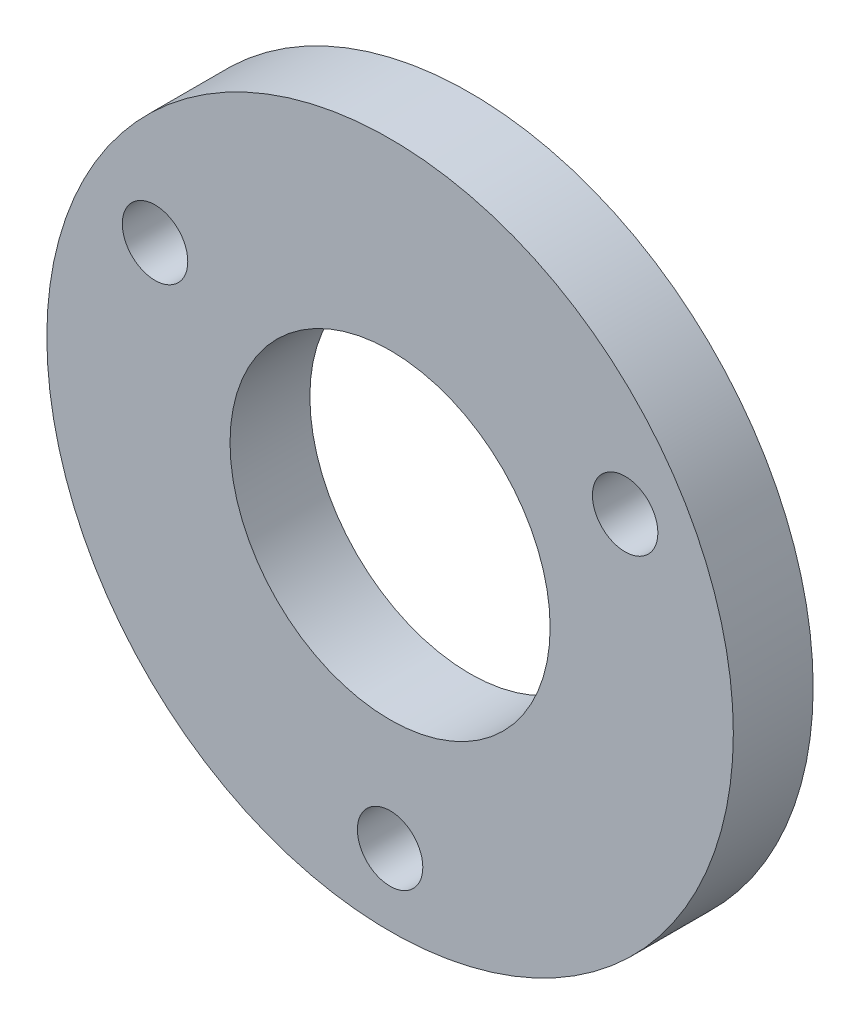
ISO-10303-21;
HEADER;
FILE_DESCRIPTION(('STEP AP214'),'2;1');
FILE_NAME('part.step','',(''),(''),'','','');
FILE_SCHEMA(('AUTOMOTIVE_DESIGN { 1 0 10303 214 1 1 1 1 }'));
ENDSEC;
DATA;
#1=APPLICATION_CONTEXT('core data for automotive mechanical design processes');
#2=APPLICATION_PROTOCOL_DEFINITION('international standard','automotive_design',2000,#1);
#3=PRODUCT_CONTEXT('',#1,'mechanical');
#4=PRODUCT('Part','Part','',(#3));
#5=PRODUCT_RELATED_PRODUCT_CATEGORY('part','',(#4));
#6=PRODUCT_DEFINITION_FORMATION('','',#4);
#7=PRODUCT_DEFINITION_CONTEXT('part definition',#1,'design');
#8=PRODUCT_DEFINITION('design','',#6,#7);
#9=PRODUCT_DEFINITION_SHAPE('','',#8);
#10=(LENGTH_UNIT() NAMED_UNIT(*) SI_UNIT(.MILLI.,.METRE.));
#11=(NAMED_UNIT(*) PLANE_ANGLE_UNIT() SI_UNIT($,.RADIAN.));
#12=(NAMED_UNIT(*) SI_UNIT($,.STERADIAN.) SOLID_ANGLE_UNIT());
#13=UNCERTAINTY_MEASURE_WITH_UNIT(LENGTH_MEASURE(1.E-05),#10,'distance_accuracy_value','');
#14=(GEOMETRIC_REPRESENTATION_CONTEXT(3) GLOBAL_UNCERTAINTY_ASSIGNED_CONTEXT((#13)) GLOBAL_UNIT_ASSIGNED_CONTEXT((#10,
#11,#12)) REPRESENTATION_CONTEXT('',''));
#15=CARTESIAN_POINT('',(0.,0.,0.));
#16=DIRECTION('',(0.,0.,1.));
#17=DIRECTION('',(1.,0.,0.));
#18=AXIS2_PLACEMENT_3D('',#15,#16,#17);
#19=CARTESIAN_POINT('',(0.,0.,5.));
#20=DIRECTION('',(0.,0.,-1.));
#21=DIRECTION('',(-1.,0.,0.));
#22=AXIS2_PLACEMENT_3D('',#19,#20,#21);
#23=CYLINDRICAL_SURFACE('',#22,21.5);
#24=CARTESIAN_POINT('',(0.,0.,5.));
#25=DIRECTION('',(0.,0.,1.));
#26=DIRECTION('',(1.,0.,0.));
#27=AXIS2_PLACEMENT_3D('',#24,#25,#26);
#28=CIRCLE('',#27,21.5);
#29=CARTESIAN_POINT('',(21.5,0.,5.));
#30=VERTEX_POINT('',#29);
#31=EDGE_CURVE('E10',#30,#30,#28,.T.);
#32=ORIENTED_EDGE('',*,*,#31,.F.);
#33=EDGE_LOOP('',(#32));
#34=FACE_BOUND('',#33,.T.);
#35=CARTESIAN_POINT('',(0.,0.,0.));
#36=DIRECTION('',(0.,0.,1.));
#37=DIRECTION('',(1.,0.,0.));
#38=AXIS2_PLACEMENT_3D('',#35,#36,#37);
#39=CIRCLE('',#38,21.5);
#40=CARTESIAN_POINT('',(21.5,0.,0.));
#41=VERTEX_POINT('',#40);
#42=EDGE_CURVE('E35',#41,#41,#39,.T.);
#43=ORIENTED_EDGE('',*,*,#42,.T.);
#44=EDGE_LOOP('',(#43));
#45=FACE_BOUND('',#44,.T.);
#46=ADVANCED_FACE('F32',(#34,#45),#23,.T.);
#47=CARTESIAN_POINT('',(0.,0.,5.));
#48=DIRECTION('',(0.,0.,1.));
#49=DIRECTION('',(1.,0.,0.));
#50=AXIS2_PLACEMENT_3D('',#47,#48,#49);
#51=PLANE('',#50);
#52=CARTESIAN_POINT('',(0.,-17.,5.));
#53=DIRECTION('',(0.,0.,1.));
#54=DIRECTION('',(1.,0.,0.));
#55=AXIS2_PLACEMENT_3D('',#52,#53,#54);
#56=CIRCLE('',#55,2.05);
#57=CARTESIAN_POINT('',(2.05,-17.,5.));
#58=VERTEX_POINT('',#57);
#59=EDGE_CURVE('E62',#58,#58,#56,.T.);
#60=ORIENTED_EDGE('',*,*,#59,.F.);
#61=EDGE_LOOP('',(#60));
#62=FACE_BOUND('',#61,.T.);
#63=CARTESIAN_POINT('',(-14.7224318643355,8.5,5.));
#64=DIRECTION('',(0.,0.,1.));
#65=DIRECTION('',(1.,0.,0.));
#66=AXIS2_PLACEMENT_3D('',#63,#64,#65);
#67=CIRCLE('',#66,2.05);
#68=CARTESIAN_POINT('',(-12.6724318643355,8.5,5.));
#69=VERTEX_POINT('',#68);
#70=EDGE_CURVE('E56',#69,#69,#67,.T.);
#71=ORIENTED_EDGE('',*,*,#70,.F.);
#72=EDGE_LOOP('',(#71));
#73=FACE_BOUND('',#72,.T.);
#74=CARTESIAN_POINT('',(14.7224318643355,8.50000000000001,5.));
#75=DIRECTION('',(0.,0.,1.));
#76=DIRECTION('',(1.,0.,0.));
#77=AXIS2_PLACEMENT_3D('',#74,#75,#76);
#78=CIRCLE('',#77,2.05);
#79=CARTESIAN_POINT('',(16.7724318643355,8.50000000000001,5.));
#80=VERTEX_POINT('',#79);
#81=EDGE_CURVE('E50',#80,#80,#78,.T.);
#82=ORIENTED_EDGE('',*,*,#81,.F.);
#83=EDGE_LOOP('',(#82));
#84=FACE_BOUND('',#83,.T.);
#85=CARTESIAN_POINT('',(0.,0.,5.));
#86=DIRECTION('',(0.,0.,1.));
#87=DIRECTION('',(1.,0.,0.));
#88=AXIS2_PLACEMENT_3D('',#85,#86,#87);
#89=CIRCLE('',#88,10.025);
#90=CARTESIAN_POINT('',(10.025,0.,5.));
#91=VERTEX_POINT('',#90);
#92=EDGE_CURVE('E44',#91,#91,#89,.T.);
#93=ORIENTED_EDGE('',*,*,#92,.F.);
#94=EDGE_LOOP('',(#93));
#95=FACE_BOUND('',#94,.T.);
#96=ORIENTED_EDGE('',*,*,#31,.T.);
#97=EDGE_LOOP('',(#96));
#98=FACE_BOUND('',#97,.T.);
#99=ADVANCED_FACE('F78',(#62,#73,#84,#95,#98),#51,.T.);
#100=CARTESIAN_POINT('',(0.,0.,0.));
#101=DIRECTION('',(0.,0.,1.));
#102=DIRECTION('',(1.,0.,0.));
#103=AXIS2_PLACEMENT_3D('',#100,#101,#102);
#104=PLANE('',#103);
#105=CARTESIAN_POINT('',(0.,-17.,0.));
#106=DIRECTION('',(0.,0.,1.));
#107=DIRECTION('',(1.,0.,0.));
#108=AXIS2_PLACEMENT_3D('',#105,#106,#107);
#109=CIRCLE('',#108,2.05);
#110=CARTESIAN_POINT('',(2.05,-17.,0.));
#111=VERTEX_POINT('',#110);
#112=EDGE_CURVE('E47',#111,#111,#109,.T.);
#113=ORIENTED_EDGE('',*,*,#112,.T.);
#114=EDGE_LOOP('',(#113));
#115=FACE_BOUND('',#114,.T.);
#116=CARTESIAN_POINT('',(-14.7224318643355,8.5,0.));
#117=DIRECTION('',(0.,0.,1.));
#118=DIRECTION('',(1.,0.,0.));
#119=AXIS2_PLACEMENT_3D('',#116,#117,#118);
#120=CIRCLE('',#119,2.05);
#121=CARTESIAN_POINT('',(-12.6724318643355,8.5,0.));
#122=VERTEX_POINT('',#121);
#123=EDGE_CURVE('E59',#122,#122,#120,.T.);
#124=ORIENTED_EDGE('',*,*,#123,.T.);
#125=EDGE_LOOP('',(#124));
#126=FACE_BOUND('',#125,.T.);
#127=CARTESIAN_POINT('',(14.7224318643355,8.50000000000001,0.));
#128=DIRECTION('',(0.,0.,1.));
#129=DIRECTION('',(1.,0.,0.));
#130=AXIS2_PLACEMENT_3D('',#127,#128,#129);
#131=CIRCLE('',#130,2.05);
#132=CARTESIAN_POINT('',(16.7724318643355,8.50000000000001,0.));
#133=VERTEX_POINT('',#132);
#134=EDGE_CURVE('E53',#133,#133,#131,.T.);
#135=ORIENTED_EDGE('',*,*,#134,.T.);
#136=EDGE_LOOP('',(#135));
#137=FACE_BOUND('',#136,.T.);
#138=CARTESIAN_POINT('',(0.,0.,0.));
#139=DIRECTION('',(0.,0.,1.));
#140=DIRECTION('',(1.,0.,0.));
#141=AXIS2_PLACEMENT_3D('',#138,#139,#140);
#142=CIRCLE('',#141,10.025);
#143=CARTESIAN_POINT('',(10.025,0.,0.));
#144=VERTEX_POINT('',#143);
#145=EDGE_CURVE('E42',#144,#144,#142,.T.);
#146=ORIENTED_EDGE('',*,*,#145,.T.);
#147=EDGE_LOOP('',(#146));
#148=FACE_BOUND('',#147,.T.);
#149=ORIENTED_EDGE('',*,*,#42,.F.);
#150=EDGE_LOOP('',(#149));
#151=FACE_BOUND('',#150,.T.);
#152=ADVANCED_FACE('F68',(#115,#126,#137,#148,#151),#104,.F.);
#153=CARTESIAN_POINT('',(0.,0.,0.));
#154=DIRECTION('',(0.,0.,1.));
#155=DIRECTION('',(1.,0.,0.));
#156=AXIS2_PLACEMENT_3D('',#153,#154,#155);
#157=CYLINDRICAL_SURFACE('',#156,10.025);
#158=ORIENTED_EDGE('',*,*,#145,.F.);
#159=EDGE_LOOP('',(#158));
#160=FACE_BOUND('',#159,.T.);
#161=ORIENTED_EDGE('',*,*,#92,.T.);
#162=EDGE_LOOP('',(#161));
#163=FACE_BOUND('',#162,.T.);
#164=ADVANCED_FACE('F88',(#160,#163),#157,.F.);
#165=CARTESIAN_POINT('',(14.7224318643355,8.50000000000001,0.));
#166=DIRECTION('',(0.,0.,1.));
#167=DIRECTION('',(1.,0.,0.));
#168=AXIS2_PLACEMENT_3D('',#165,#166,#167);
#169=CYLINDRICAL_SURFACE('',#168,2.05);
#170=ORIENTED_EDGE('',*,*,#134,.F.);
#171=EDGE_LOOP('',(#170));
#172=FACE_BOUND('',#171,.T.);
#173=ORIENTED_EDGE('',*,*,#81,.T.);
#174=EDGE_LOOP('',(#173));
#175=FACE_BOUND('',#174,.T.);
#176=ADVANCED_FACE('F90',(#172,#175),#169,.F.);
#177=CARTESIAN_POINT('',(-14.7224318643355,8.5,0.));
#178=DIRECTION('',(0.,0.,1.));
#179=DIRECTION('',(1.,0.,0.));
#180=AXIS2_PLACEMENT_3D('',#177,#178,#179);
#181=CYLINDRICAL_SURFACE('',#180,2.05);
#182=ORIENTED_EDGE('',*,*,#123,.F.);
#183=EDGE_LOOP('',(#182));
#184=FACE_BOUND('',#183,.T.);
#185=ORIENTED_EDGE('',*,*,#70,.T.);
#186=EDGE_LOOP('',(#185));
#187=FACE_BOUND('',#186,.T.);
#188=ADVANCED_FACE('F74',(#184,#187),#181,.F.);
#189=CARTESIAN_POINT('',(0.,-17.,0.));
#190=DIRECTION('',(0.,0.,1.));
#191=DIRECTION('',(1.,0.,0.));
#192=AXIS2_PLACEMENT_3D('',#189,#190,#191);
#193=CYLINDRICAL_SURFACE('',#192,2.05);
#194=ORIENTED_EDGE('',*,*,#112,.F.);
#195=EDGE_LOOP('',(#194));
#196=FACE_BOUND('',#195,.T.);
#197=ORIENTED_EDGE('',*,*,#59,.T.);
#198=EDGE_LOOP('',(#197));
#199=FACE_BOUND('',#198,.T.);
#200=ADVANCED_FACE('F71',(#196,#199),#193,.F.);
#201=CLOSED_SHELL('',(#46,#99,#152,#164,#176,#188,#200));
#202=MANIFOLD_SOLID_BREP('B2',#201);
#203=ADVANCED_BREP_SHAPE_REPRESENTATION('',(#18,#202),#14);
#204=SHAPE_DEFINITION_REPRESENTATION(#9,#203);
ENDSEC;
END-ISO-10303-21;
